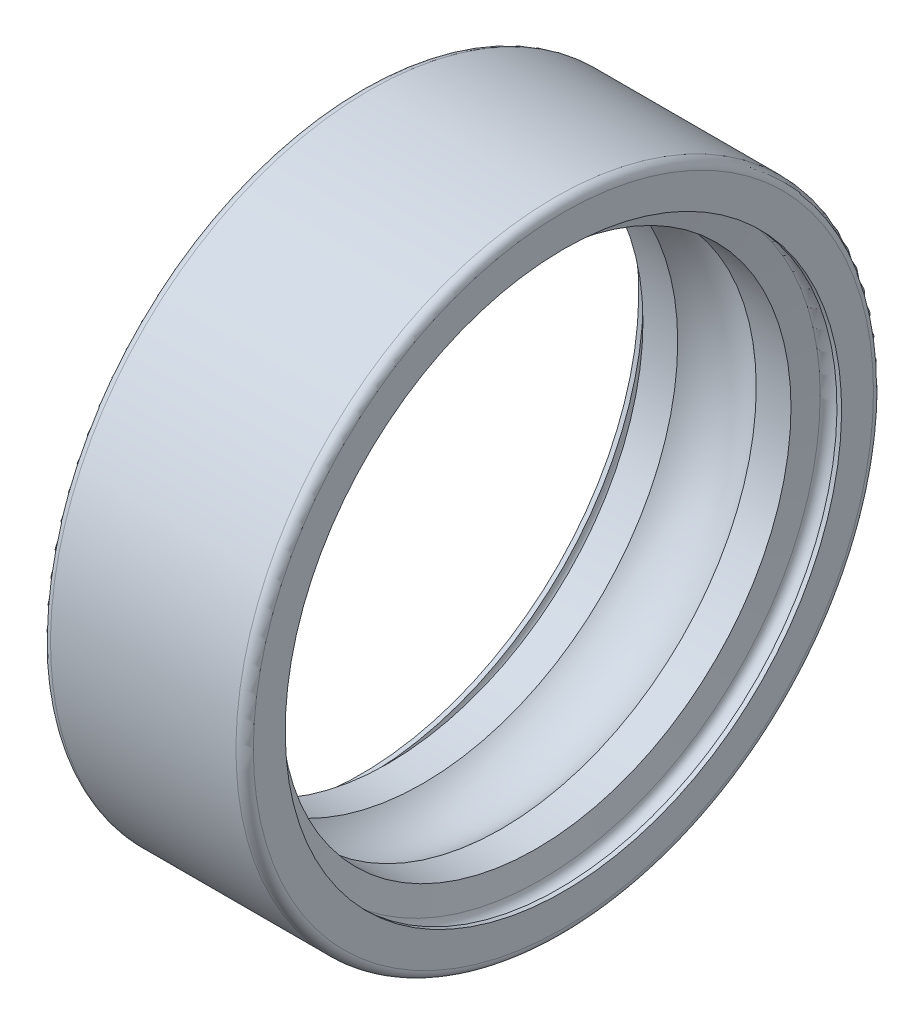
ISO-10303-21;
HEADER;
FILE_DESCRIPTION(('STEP AP214'),'2;1');
FILE_NAME('part.step','',(''),(''),'','','');
FILE_SCHEMA(('AUTOMOTIVE_DESIGN { 1 0 10303 214 1 1 1 1 }'));
ENDSEC;
DATA;
#1=APPLICATION_CONTEXT('core data for automotive mechanical design processes');
#2=APPLICATION_PROTOCOL_DEFINITION('international standard','automotive_design',2000,#1);
#3=PRODUCT_CONTEXT('',#1,'mechanical');
#4=PRODUCT('Part','Part','',(#3));
#5=PRODUCT_RELATED_PRODUCT_CATEGORY('part','',(#4));
#6=PRODUCT_DEFINITION_FORMATION('','',#4);
#7=PRODUCT_DEFINITION_CONTEXT('part definition',#1,'design');
#8=PRODUCT_DEFINITION('design','',#6,#7);
#9=PRODUCT_DEFINITION_SHAPE('','',#8);
#10=(LENGTH_UNIT() NAMED_UNIT(*) SI_UNIT(.MILLI.,.METRE.));
#11=(NAMED_UNIT(*) PLANE_ANGLE_UNIT() SI_UNIT($,.RADIAN.));
#12=(NAMED_UNIT(*) SI_UNIT($,.STERADIAN.) SOLID_ANGLE_UNIT());
#13=UNCERTAINTY_MEASURE_WITH_UNIT(LENGTH_MEASURE(1.E-05),#10,'distance_accuracy_value','');
#14=(GEOMETRIC_REPRESENTATION_CONTEXT(3) GLOBAL_UNCERTAINTY_ASSIGNED_CONTEXT((#13)) GLOBAL_UNIT_ASSIGNED_CONTEXT((#10,
#11,#12)) REPRESENTATION_CONTEXT('',''));
#15=CARTESIAN_POINT('',(0.,0.,0.));
#16=DIRECTION('',(0.,0.,1.));
#17=DIRECTION('',(1.,0.,0.));
#18=AXIS2_PLACEMENT_3D('',#15,#16,#17);
#19=CARTESIAN_POINT('',(6.52,0.,0.));
#20=DIRECTION('',(1.,0.,0.));
#21=DIRECTION('',(0.,0.,-1.));
#22=AXIS2_PLACEMENT_3D('',#19,#20,#21);
#23=TOROIDAL_SURFACE('',#22,9.6,0.32);
#24=CARTESIAN_POINT('',(6.84,0.,0.));
#25=DIRECTION('',(1.,0.,0.));
#26=DIRECTION('',(0.,1.,0.));
#27=AXIS2_PLACEMENT_3D('',#24,#25,#26);
#28=CIRCLE('',#27,9.6);
#29=CARTESIAN_POINT('',(6.84,9.6,0.));
#30=VERTEX_POINT('',#29);
#31=EDGE_CURVE('E11',#30,#30,#28,.T.);
#32=ORIENTED_EDGE('',*,*,#31,.T.);
#33=EDGE_LOOP('',(#32));
#34=FACE_BOUND('',#33,.T.);
#35=CARTESIAN_POINT('',(6.20486151903609,0.,0.));
#36=DIRECTION('',(1.,0.,0.));
#37=DIRECTION('',(0.,1.,0.));
#38=AXIS2_PLACEMENT_3D('',#35,#36,#37);
#39=CIRCLE('',#38,9.65556741685342);
#40=CARTESIAN_POINT('',(6.20486151903609,9.65556741685342,0.));
#41=VERTEX_POINT('',#40);
#42=EDGE_CURVE('E63',#41,#41,#39,.T.);
#43=ORIENTED_EDGE('',*,*,#42,.F.);
#44=EDGE_LOOP('',(#43));
#45=FACE_BOUND('',#44,.T.);
#46=ADVANCED_FACE('F16',(#34,#45),#23,.F.);
#47=CARTESIAN_POINT('',(6.92,0.,0.));
#48=DIRECTION('',(-1.,0.,0.));
#49=DIRECTION('',(0.,1.,0.));
#50=AXIS2_PLACEMENT_3D('',#47,#48,#49);
#51=CYLINDRICAL_SURFACE('',#50,9.6);
#52=CARTESIAN_POINT('',(7.,0.,0.));
#53=DIRECTION('',(1.,0.,0.));
#54=DIRECTION('',(0.,1.,0.));
#55=AXIS2_PLACEMENT_3D('',#52,#53,#54);
#56=CIRCLE('',#55,9.6);
#57=CARTESIAN_POINT('',(7.,9.6,0.));
#58=VERTEX_POINT('',#57);
#59=EDGE_CURVE('E26',#58,#58,#56,.T.);
#60=ORIENTED_EDGE('',*,*,#59,.T.);
#61=EDGE_LOOP('',(#60));
#62=FACE_BOUND('',#61,.T.);
#63=ORIENTED_EDGE('',*,*,#31,.F.);
#64=EDGE_LOOP('',(#63));
#65=FACE_BOUND('',#64,.T.);
#66=ADVANCED_FACE('F129',(#62,#65),#51,.F.);
#67=CARTESIAN_POINT('',(7.,10.15,0.));
#68=DIRECTION('',(1.,0.,0.));
#69=DIRECTION('',(0.,1.,0.));
#70=AXIS2_PLACEMENT_3D('',#67,#68,#69);
#71=PLANE('',#70);
#72=CARTESIAN_POINT('',(7.,0.,0.));
#73=DIRECTION('',(1.,0.,0.));
#74=DIRECTION('',(0.,1.,0.));
#75=AXIS2_PLACEMENT_3D('',#72,#73,#74);
#76=CIRCLE('',#75,10.7);
#77=CARTESIAN_POINT('',(7.,10.7,0.));
#78=VERTEX_POINT('',#77);
#79=EDGE_CURVE('E83',#78,#78,#76,.T.);
#80=ORIENTED_EDGE('',*,*,#79,.T.);
#81=EDGE_LOOP('',(#80));
#82=FACE_BOUND('',#81,.T.);
#83=ORIENTED_EDGE('',*,*,#59,.F.);
#84=EDGE_LOOP('',(#83));
#85=FACE_BOUND('',#84,.T.);
#86=ADVANCED_FACE('F84',(#82,#85),#71,.T.);
#87=CARTESIAN_POINT('',(6.7,0.,0.));
#88=DIRECTION('',(1.,0.,0.));
#89=DIRECTION('',(0.,0.,-1.));
#90=AXIS2_PLACEMENT_3D('',#87,#88,#89);
#91=TOROIDAL_SURFACE('',#90,10.7,0.3);
#92=CARTESIAN_POINT('',(6.7,0.,0.));
#93=DIRECTION('',(1.,0.,0.));
#94=DIRECTION('',(0.,1.,0.));
#95=AXIS2_PLACEMENT_3D('',#92,#93,#94);
#96=CIRCLE('',#95,11.);
#97=CARTESIAN_POINT('',(6.7,11.,0.));
#98=VERTEX_POINT('',#97);
#99=EDGE_CURVE('E87',#98,#98,#96,.T.);
#100=ORIENTED_EDGE('',*,*,#99,.T.);
#101=EDGE_LOOP('',(#100));
#102=FACE_BOUND('',#101,.T.);
#103=ORIENTED_EDGE('',*,*,#79,.F.);
#104=EDGE_LOOP('',(#103));
#105=FACE_BOUND('',#104,.T.);
#106=ADVANCED_FACE('F124',(#102,#105),#91,.T.);
#107=CARTESIAN_POINT('',(3.5,0.,0.));
#108=DIRECTION('',(-1.,0.,0.));
#109=DIRECTION('',(0.,1.,0.));
#110=AXIS2_PLACEMENT_3D('',#107,#108,#109);
#111=CYLINDRICAL_SURFACE('',#110,11.);
#112=CARTESIAN_POINT('',(0.3,0.,0.));
#113=DIRECTION('',(1.,0.,0.));
#114=DIRECTION('',(0.,1.,0.));
#115=AXIS2_PLACEMENT_3D('',#112,#113,#114);
#116=CIRCLE('',#115,11.);
#117=CARTESIAN_POINT('',(0.3,11.,0.));
#118=VERTEX_POINT('',#117);
#119=EDGE_CURVE('E90',#118,#118,#116,.T.);
#120=ORIENTED_EDGE('',*,*,#119,.T.);
#121=EDGE_LOOP('',(#120));
#122=FACE_BOUND('',#121,.T.);
#123=ORIENTED_EDGE('',*,*,#99,.F.);
#124=EDGE_LOOP('',(#123));
#125=FACE_BOUND('',#124,.T.);
#126=ADVANCED_FACE('F110',(#122,#125),#111,.T.);
#127=CARTESIAN_POINT('',(0.3,0.,0.));
#128=DIRECTION('',(1.,0.,0.));
#129=DIRECTION('',(0.,0.,-1.));
#130=AXIS2_PLACEMENT_3D('',#127,#128,#129);
#131=TOROIDAL_SURFACE('',#130,10.7,0.3);
#132=CARTESIAN_POINT('',(0.,0.,0.));
#133=DIRECTION('',(1.,0.,0.));
#134=DIRECTION('',(0.,1.,0.));
#135=AXIS2_PLACEMENT_3D('',#132,#133,#134);
#136=CIRCLE('',#135,10.7);
#137=CARTESIAN_POINT('',(0.,10.7,0.));
#138=VERTEX_POINT('',#137);
#139=EDGE_CURVE('E102',#138,#138,#136,.T.);
#140=ORIENTED_EDGE('',*,*,#139,.T.);
#141=EDGE_LOOP('',(#140));
#142=FACE_BOUND('',#141,.T.);
#143=ORIENTED_EDGE('',*,*,#119,.F.);
#144=EDGE_LOOP('',(#143));
#145=FACE_BOUND('',#144,.T.);
#146=ADVANCED_FACE('F113',(#142,#145),#131,.T.);
#147=CARTESIAN_POINT('',(0.,10.15,0.));
#148=DIRECTION('',(-1.,0.,0.));
#149=DIRECTION('',(0.,-1.,0.));
#150=AXIS2_PLACEMENT_3D('',#147,#148,#149);
#151=PLANE('',#150);
#152=CARTESIAN_POINT('',(0.,0.,0.));
#153=DIRECTION('',(1.,0.,0.));
#154=DIRECTION('',(0.,1.,0.));
#155=AXIS2_PLACEMENT_3D('',#152,#153,#154);
#156=CIRCLE('',#155,9.6);
#157=CARTESIAN_POINT('',(0.,9.6,0.));
#158=VERTEX_POINT('',#157);
#159=EDGE_CURVE('E51',#158,#158,#156,.T.);
#160=ORIENTED_EDGE('',*,*,#159,.T.);
#161=EDGE_LOOP('',(#160));
#162=FACE_BOUND('',#161,.T.);
#163=ORIENTED_EDGE('',*,*,#139,.F.);
#164=EDGE_LOOP('',(#163));
#165=FACE_BOUND('',#164,.T.);
#166=ADVANCED_FACE('F115',(#162,#165),#151,.T.);
#167=CARTESIAN_POINT('',(0.08,0.,0.));
#168=DIRECTION('',(-1.,0.,0.));
#169=DIRECTION('',(0.,1.,0.));
#170=AXIS2_PLACEMENT_3D('',#167,#168,#169);
#171=CYLINDRICAL_SURFACE('',#170,9.6);
#172=CARTESIAN_POINT('',(0.16,0.,0.));
#173=DIRECTION('',(1.,0.,0.));
#174=DIRECTION('',(0.,1.,0.));
#175=AXIS2_PLACEMENT_3D('',#172,#173,#174);
#176=CIRCLE('',#175,9.6);
#177=CARTESIAN_POINT('',(0.16,9.6,0.));
#178=VERTEX_POINT('',#177);
#179=EDGE_CURVE('E56',#178,#178,#176,.T.);
#180=ORIENTED_EDGE('',*,*,#179,.T.);
#181=EDGE_LOOP('',(#180));
#182=FACE_BOUND('',#181,.T.);
#183=ORIENTED_EDGE('',*,*,#159,.F.);
#184=EDGE_LOOP('',(#183));
#185=FACE_BOUND('',#184,.T.);
#186=ADVANCED_FACE('F122',(#182,#185),#171,.F.);
#187=CARTESIAN_POINT('',(0.48,0.,0.));
#188=DIRECTION('',(1.,0.,0.));
#189=DIRECTION('',(0.,0.,-1.));
#190=AXIS2_PLACEMENT_3D('',#187,#188,#189);
#191=TOROIDAL_SURFACE('',#190,9.6,0.32);
#192=CARTESIAN_POINT('',(0.795138480963905,0.,0.));
#193=DIRECTION('',(1.,0.,0.));
#194=DIRECTION('',(0.,1.,0.));
#195=AXIS2_PLACEMENT_3D('',#192,#193,#194);
#196=CIRCLE('',#195,9.65556741685342);
#197=CARTESIAN_POINT('',(0.795138480963905,9.65556741685342,0.));
#198=VERTEX_POINT('',#197);
#199=EDGE_CURVE('E96',#198,#198,#196,.T.);
#200=ORIENTED_EDGE('',*,*,#199,.T.);
#201=EDGE_LOOP('',(#200));
#202=FACE_BOUND('',#201,.T.);
#203=ORIENTED_EDGE('',*,*,#179,.F.);
#204=EDGE_LOOP('',(#203));
#205=FACE_BOUND('',#204,.T.);
#206=ADVANCED_FACE('F149',(#202,#205),#191,.F.);
#207=CARTESIAN_POINT('',(0.870568290667057,0.,0.));
#208=DIRECTION('',(-1.,0.,0.));
#209=DIRECTION('',(0.,1.,0.));
#210=AXIS2_PLACEMENT_3D('',#207,#208,#209);
#211=CONICAL_SURFACE('',#210,9.22778370842671,1.39626340159546);
#212=CARTESIAN_POINT('',(0.945998100370209,0.,0.));
#213=DIRECTION('',(1.,0.,0.));
#214=DIRECTION('',(0.,1.,0.));
#215=AXIS2_PLACEMENT_3D('',#212,#213,#214);
#216=CIRCLE('',#215,8.8);
#217=CARTESIAN_POINT('',(0.945998100370209,8.8,0.));
#218=VERTEX_POINT('',#217);
#219=EDGE_CURVE('E98',#218,#218,#216,.T.);
#220=ORIENTED_EDGE('',*,*,#219,.T.);
#221=EDGE_LOOP('',(#220));
#222=FACE_BOUND('',#221,.T.);
#223=ORIENTED_EDGE('',*,*,#199,.F.);
#224=EDGE_LOOP('',(#223));
#225=FACE_BOUND('',#224,.T.);
#226=ADVANCED_FACE('F148',(#222,#225),#211,.F.);
#227=CARTESIAN_POINT('',(1.54555158912263,0.,0.));
#228=DIRECTION('',(-1.,0.,0.));
#229=DIRECTION('',(0.,1.,0.));
#230=AXIS2_PLACEMENT_3D('',#227,#228,#229);
#231=CYLINDRICAL_SURFACE('',#230,8.8);
#232=CARTESIAN_POINT('',(2.14510507787504,0.,0.));
#233=DIRECTION('',(1.,0.,0.));
#234=DIRECTION('',(0.,1.,0.));
#235=AXIS2_PLACEMENT_3D('',#232,#233,#234);
#236=CIRCLE('',#235,8.8);
#237=CARTESIAN_POINT('',(2.14510507787504,8.8,0.));
#238=VERTEX_POINT('',#237);
#239=EDGE_CURVE('E72',#238,#238,#236,.T.);
#240=ORIENTED_EDGE('',*,*,#239,.T.);
#241=EDGE_LOOP('',(#240));
#242=FACE_BOUND('',#241,.T.);
#243=ORIENTED_EDGE('',*,*,#219,.F.);
#244=EDGE_LOOP('',(#243));
#245=FACE_BOUND('',#244,.T.);
#246=ADVANCED_FACE('F142',(#242,#245),#231,.F.);
#247=CARTESIAN_POINT('',(3.5,0.,0.));
#248=DIRECTION('',(1.,0.,0.));
#249=DIRECTION('',(0.,0.,-1.));
#250=AXIS2_PLACEMENT_3D('',#247,#248,#249);
#251=TOROIDAL_SURFACE('',#250,7.35,1.9845);
#252=CARTESIAN_POINT('',(4.85489492212496,0.,0.));
#253=DIRECTION('',(1.,0.,0.));
#254=DIRECTION('',(0.,1.,0.));
#255=AXIS2_PLACEMENT_3D('',#252,#253,#254);
#256=CIRCLE('',#255,8.8);
#257=CARTESIAN_POINT('',(4.85489492212496,8.8,0.));
#258=VERTEX_POINT('',#257);
#259=EDGE_CURVE('E20',#258,#258,#256,.T.);
#260=ORIENTED_EDGE('',*,*,#259,.T.);
#261=EDGE_LOOP('',(#260));
#262=FACE_BOUND('',#261,.T.);
#263=ORIENTED_EDGE('',*,*,#239,.F.);
#264=EDGE_LOOP('',(#263));
#265=FACE_BOUND('',#264,.T.);
#266=ADVANCED_FACE('F139',(#262,#265),#251,.F.);
#267=CARTESIAN_POINT('',(5.45444841087738,0.,0.));
#268=DIRECTION('',(-1.,0.,0.));
#269=DIRECTION('',(0.,1.,0.));
#270=AXIS2_PLACEMENT_3D('',#267,#268,#269);
#271=CYLINDRICAL_SURFACE('',#270,8.8);
#272=CARTESIAN_POINT('',(6.05400189962979,0.,0.));
#273=DIRECTION('',(1.,0.,0.));
#274=DIRECTION('',(0.,1.,0.));
#275=AXIS2_PLACEMENT_3D('',#272,#273,#274);
#276=CIRCLE('',#275,8.8);
#277=CARTESIAN_POINT('',(6.05400189962979,8.8,0.));
#278=VERTEX_POINT('',#277);
#279=EDGE_CURVE('E99',#278,#278,#276,.T.);
#280=ORIENTED_EDGE('',*,*,#279,.T.);
#281=EDGE_LOOP('',(#280));
#282=FACE_BOUND('',#281,.T.);
#283=ORIENTED_EDGE('',*,*,#259,.F.);
#284=EDGE_LOOP('',(#283));
#285=FACE_BOUND('',#284,.T.);
#286=ADVANCED_FACE('F18',(#282,#285),#271,.F.);
#287=CARTESIAN_POINT('',(6.12943170933294,0.,0.));
#288=DIRECTION('',(1.,0.,0.));
#289=DIRECTION('',(0.,1.,0.));
#290=AXIS2_PLACEMENT_3D('',#287,#288,#289);
#291=CONICAL_SURFACE('',#290,9.22778370842671,1.39626340159546);
#292=ORIENTED_EDGE('',*,*,#42,.T.);
#293=EDGE_LOOP('',(#292));
#294=FACE_BOUND('',#293,.T.);
#295=ORIENTED_EDGE('',*,*,#279,.F.);
#296=EDGE_LOOP('',(#295));
#297=FACE_BOUND('',#296,.T.);
#298=ADVANCED_FACE('F153',(#294,#297),#291,.F.);
#299=CLOSED_SHELL('',(#46,#66,#86,#106,#126,#146,#166,#186,#206,#226,#246,#266,#286,#298));
#300=MANIFOLD_SOLID_BREP('B1',#299);
#301=ADVANCED_BREP_SHAPE_REPRESENTATION('',(#18,#300),#14);
#302=SHAPE_DEFINITION_REPRESENTATION(#9,#301);
ENDSEC;
END-ISO-10303-21;
